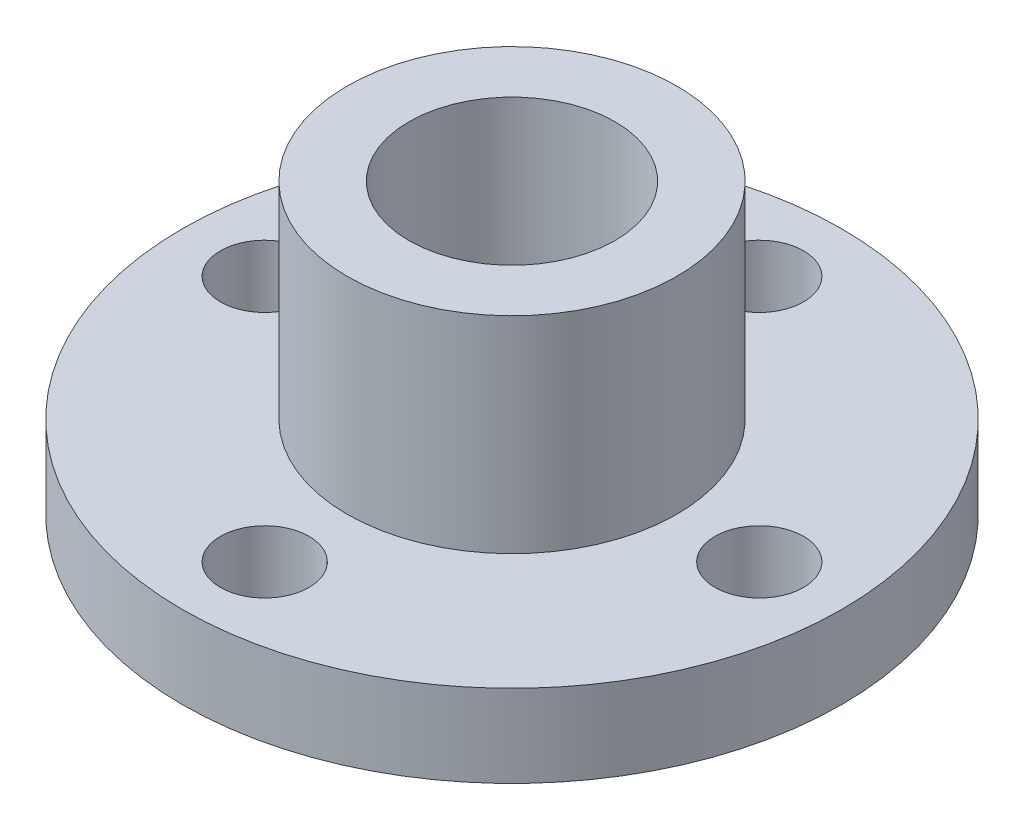
ISO-10303-21;
HEADER;
FILE_DESCRIPTION(('STEP AP214'),'2;1');
FILE_NAME('part.step','',(''),(''),'','','');
FILE_SCHEMA(('AUTOMOTIVE_DESIGN { 1 0 10303 214 1 1 1 1 }'));
ENDSEC;
DATA;
#1=APPLICATION_CONTEXT('core data for automotive mechanical design processes');
#2=APPLICATION_PROTOCOL_DEFINITION('international standard','automotive_design',2000,#1);
#3=PRODUCT_CONTEXT('',#1,'mechanical');
#4=PRODUCT('Part','Part','',(#3));
#5=PRODUCT_RELATED_PRODUCT_CATEGORY('part','',(#4));
#6=PRODUCT_DEFINITION_FORMATION('','',#4);
#7=PRODUCT_DEFINITION_CONTEXT('part definition',#1,'design');
#8=PRODUCT_DEFINITION('design','',#6,#7);
#9=PRODUCT_DEFINITION_SHAPE('','',#8);
#10=(LENGTH_UNIT() NAMED_UNIT(*) SI_UNIT(.MILLI.,.METRE.));
#11=(NAMED_UNIT(*) PLANE_ANGLE_UNIT() SI_UNIT($,.RADIAN.));
#12=(NAMED_UNIT(*) SI_UNIT($,.STERADIAN.) SOLID_ANGLE_UNIT());
#13=UNCERTAINTY_MEASURE_WITH_UNIT(LENGTH_MEASURE(1.E-05),#10,'distance_accuracy_value','');
#14=(GEOMETRIC_REPRESENTATION_CONTEXT(3) GLOBAL_UNCERTAINTY_ASSIGNED_CONTEXT((#13)) GLOBAL_UNIT_ASSIGNED_CONTEXT((#10,
#11,#12)) REPRESENTATION_CONTEXT('',''));
#15=CARTESIAN_POINT('',(0.,0.,0.));
#16=DIRECTION('',(0.,0.,1.));
#17=DIRECTION('',(1.,0.,0.));
#18=AXIS2_PLACEMENT_3D('',#15,#16,#17);
#19=CARTESIAN_POINT('',(0.,0.,-5.));
#20=DIRECTION('',(0.,-1.,0.));
#21=DIRECTION('',(0.,0.,-1.));
#22=AXIS2_PLACEMENT_3D('',#19,#20,#21);
#23=PLANE('',#22);
#24=CARTESIAN_POINT('',(0.,0.,0.));
#25=DIRECTION('',(0.,1.,0.));
#26=DIRECTION('',(0.,0.,1.));
#27=AXIS2_PLACEMENT_3D('',#24,#25,#26);
#28=CIRCLE('',#27,5.);
#29=CARTESIAN_POINT('',(0.,0.,5.));
#30=VERTEX_POINT('',#29);
#31=EDGE_CURVE('E64',#30,#30,#28,.T.);
#32=ORIENTED_EDGE('',*,*,#31,.F.);
#33=EDGE_LOOP('',(#32));
#34=FACE_BOUND('',#33,.T.);
#35=CARTESIAN_POINT('',(0.,0.,0.));
#36=DIRECTION('',(0.,1.,0.));
#37=DIRECTION('',(0.,0.,1.));
#38=AXIS2_PLACEMENT_3D('',#35,#36,#37);
#39=CIRCLE('',#38,8.);
#40=CARTESIAN_POINT('',(0.,0.,8.));
#41=VERTEX_POINT('',#40);
#42=EDGE_CURVE('E10',#41,#41,#39,.T.);
#43=ORIENTED_EDGE('',*,*,#42,.T.);
#44=EDGE_LOOP('',(#43));
#45=FACE_BOUND('',#44,.T.);
#46=ADVANCED_FACE('F37',(#34,#45),#23,.F.);
#47=CARTESIAN_POINT('',(0.,0.,0.));
#48=DIRECTION('',(0.,1.,0.));
#49=DIRECTION('',(0.,0.,1.));
#50=AXIS2_PLACEMENT_3D('',#47,#48,#49);
#51=CYLINDRICAL_SURFACE('',#50,8.);
#52=ORIENTED_EDGE('',*,*,#42,.F.);
#53=EDGE_LOOP('',(#52));
#54=FACE_BOUND('',#53,.T.);
#55=CARTESIAN_POINT('',(0.,-10.,0.));
#56=DIRECTION('',(0.,1.,0.));
#57=DIRECTION('',(0.,0.,1.));
#58=AXIS2_PLACEMENT_3D('',#55,#56,#57);
#59=CIRCLE('',#58,8.);
#60=CARTESIAN_POINT('',(0.,-10.,8.));
#61=VERTEX_POINT('',#60);
#62=EDGE_CURVE('E44',#61,#61,#59,.T.);
#63=ORIENTED_EDGE('',*,*,#62,.T.);
#64=EDGE_LOOP('',(#63));
#65=FACE_BOUND('',#64,.T.);
#66=ADVANCED_FACE('F115',(#54,#65),#51,.T.);
#67=CARTESIAN_POINT('',(0.,-10.,-8.));
#68=DIRECTION('',(0.,-1.,0.));
#69=DIRECTION('',(0.,0.,-1.));
#70=AXIS2_PLACEMENT_3D('',#67,#68,#69);
#71=PLANE('',#70);
#72=CARTESIAN_POINT('',(0.,-10.,-12.));
#73=DIRECTION('',(0.,1.,0.));
#74=DIRECTION('',(-1.,0.,0.));
#75=AXIS2_PLACEMENT_3D('',#72,#73,#74);
#76=CIRCLE('',#75,2.15);
#77=CARTESIAN_POINT('',(-2.14999999999996,-10.,-12.));
#78=VERTEX_POINT('',#77);
#79=EDGE_CURVE('E93',#78,#78,#76,.T.);
#80=ORIENTED_EDGE('',*,*,#79,.F.);
#81=EDGE_LOOP('',(#80));
#82=FACE_BOUND('',#81,.T.);
#83=CARTESIAN_POINT('',(12.,-10.,0.));
#84=DIRECTION('',(0.,1.,0.));
#85=DIRECTION('',(0.,0.,-1.));
#86=AXIS2_PLACEMENT_3D('',#83,#84,#85);
#87=CIRCLE('',#86,2.15);
#88=CARTESIAN_POINT('',(12.,-10.,-2.15));
#89=VERTEX_POINT('',#88);
#90=EDGE_CURVE('E85',#89,#89,#87,.T.);
#91=ORIENTED_EDGE('',*,*,#90,.F.);
#92=EDGE_LOOP('',(#91));
#93=FACE_BOUND('',#92,.T.);
#94=CARTESIAN_POINT('',(-1.25693328198353E-13,-10.,12.));
#95=DIRECTION('',(0.,1.,0.));
#96=DIRECTION('',(1.,0.,0.));
#97=AXIS2_PLACEMENT_3D('',#94,#95,#96);
#98=CIRCLE('',#97,2.15);
#99=CARTESIAN_POINT('',(2.14999999999987,-10.,12.));
#100=VERTEX_POINT('',#99);
#101=EDGE_CURVE('E77',#100,#100,#98,.T.);
#102=ORIENTED_EDGE('',*,*,#101,.F.);
#103=EDGE_LOOP('',(#102));
#104=FACE_BOUND('',#103,.T.);
#105=CARTESIAN_POINT('',(-12.,-10.,0.));
#106=DIRECTION('',(0.,1.,0.));
#107=DIRECTION('',(0.,0.,1.));
#108=AXIS2_PLACEMENT_3D('',#105,#106,#107);
#109=CIRCLE('',#108,2.15);
#110=CARTESIAN_POINT('',(-12.,-10.,2.15));
#111=VERTEX_POINT('',#110);
#112=EDGE_CURVE('E69',#111,#111,#109,.T.);
#113=ORIENTED_EDGE('',*,*,#112,.F.);
#114=EDGE_LOOP('',(#113));
#115=FACE_BOUND('',#114,.T.);
#116=ORIENTED_EDGE('',*,*,#62,.F.);
#117=EDGE_LOOP('',(#116));
#118=FACE_BOUND('',#117,.T.);
#119=CARTESIAN_POINT('',(0.,-10.,0.));
#120=DIRECTION('',(0.,1.,0.));
#121=DIRECTION('',(0.,0.,1.));
#122=AXIS2_PLACEMENT_3D('',#119,#120,#121);
#123=CIRCLE('',#122,16.);
#124=CARTESIAN_POINT('',(0.,-10.,16.));
#125=VERTEX_POINT('',#124);
#126=EDGE_CURVE('E49',#125,#125,#123,.T.);
#127=ORIENTED_EDGE('',*,*,#126,.T.);
#128=EDGE_LOOP('',(#127));
#129=FACE_BOUND('',#128,.T.);
#130=ADVANCED_FACE('F111',(#82,#93,#104,#115,#118,#129),#71,.F.);
#131=CARTESIAN_POINT('',(0.,0.,0.));
#132=DIRECTION('',(0.,1.,0.));
#133=DIRECTION('',(0.,0.,1.));
#134=AXIS2_PLACEMENT_3D('',#131,#132,#133);
#135=CYLINDRICAL_SURFACE('',#134,16.);
#136=ORIENTED_EDGE('',*,*,#126,.F.);
#137=EDGE_LOOP('',(#136));
#138=FACE_BOUND('',#137,.T.);
#139=CARTESIAN_POINT('',(0.,-14.,0.));
#140=DIRECTION('',(0.,1.,0.));
#141=DIRECTION('',(0.,0.,1.));
#142=AXIS2_PLACEMENT_3D('',#139,#140,#141);
#143=CIRCLE('',#142,16.);
#144=CARTESIAN_POINT('',(0.,-14.,16.));
#145=VERTEX_POINT('',#144);
#146=EDGE_CURVE('E54',#145,#145,#143,.T.);
#147=ORIENTED_EDGE('',*,*,#146,.T.);
#148=EDGE_LOOP('',(#147));
#149=FACE_BOUND('',#148,.T.);
#150=ADVANCED_FACE('F114',(#138,#149),#135,.T.);
#151=CARTESIAN_POINT('',(0.,-14.,-16.));
#152=DIRECTION('',(0.,1.,0.));
#153=DIRECTION('',(0.,0.,1.));
#154=AXIS2_PLACEMENT_3D('',#151,#152,#153);
#155=PLANE('',#154);
#156=CARTESIAN_POINT('',(0.,-14.,-12.));
#157=DIRECTION('',(0.,1.,0.));
#158=DIRECTION('',(-1.,0.,0.));
#159=AXIS2_PLACEMENT_3D('',#156,#157,#158);
#160=CIRCLE('',#159,2.15);
#161=CARTESIAN_POINT('',(-2.14999999999996,-14.,-12.));
#162=VERTEX_POINT('',#161);
#163=EDGE_CURVE('E73',#162,#162,#160,.T.);
#164=ORIENTED_EDGE('',*,*,#163,.T.);
#165=EDGE_LOOP('',(#164));
#166=FACE_BOUND('',#165,.T.);
#167=CARTESIAN_POINT('',(12.,-14.,0.));
#168=DIRECTION('',(0.,1.,0.));
#169=DIRECTION('',(0.,0.,-1.));
#170=AXIS2_PLACEMENT_3D('',#167,#168,#169);
#171=CIRCLE('',#170,2.15);
#172=CARTESIAN_POINT('',(12.,-14.,-2.15));
#173=VERTEX_POINT('',#172);
#174=EDGE_CURVE('E89',#173,#173,#171,.T.);
#175=ORIENTED_EDGE('',*,*,#174,.T.);
#176=EDGE_LOOP('',(#175));
#177=FACE_BOUND('',#176,.T.);
#178=CARTESIAN_POINT('',(-1.25693328198353E-13,-14.,12.));
#179=DIRECTION('',(0.,1.,0.));
#180=DIRECTION('',(1.,0.,0.));
#181=AXIS2_PLACEMENT_3D('',#178,#179,#180);
#182=CIRCLE('',#181,2.15);
#183=CARTESIAN_POINT('',(2.14999999999987,-14.,12.));
#184=VERTEX_POINT('',#183);
#185=EDGE_CURVE('E81',#184,#184,#182,.T.);
#186=ORIENTED_EDGE('',*,*,#185,.T.);
#187=EDGE_LOOP('',(#186));
#188=FACE_BOUND('',#187,.T.);
#189=CARTESIAN_POINT('',(-12.,-14.,0.));
#190=DIRECTION('',(0.,1.,0.));
#191=DIRECTION('',(0.,0.,1.));
#192=AXIS2_PLACEMENT_3D('',#189,#190,#191);
#193=CIRCLE('',#192,2.15);
#194=CARTESIAN_POINT('',(-12.,-14.,2.15));
#195=VERTEX_POINT('',#194);
#196=EDGE_CURVE('E68',#195,#195,#193,.T.);
#197=ORIENTED_EDGE('',*,*,#196,.T.);
#198=EDGE_LOOP('',(#197));
#199=FACE_BOUND('',#198,.T.);
#200=ORIENTED_EDGE('',*,*,#146,.F.);
#201=EDGE_LOOP('',(#200));
#202=FACE_BOUND('',#201,.T.);
#203=CARTESIAN_POINT('',(0.,-14.,0.));
#204=DIRECTION('',(0.,1.,0.));
#205=DIRECTION('',(0.,0.,1.));
#206=AXIS2_PLACEMENT_3D('',#203,#204,#205);
#207=CIRCLE('',#206,5.);
#208=CARTESIAN_POINT('',(0.,-14.,5.));
#209=VERTEX_POINT('',#208);
#210=EDGE_CURVE('E60',#209,#209,#207,.T.);
#211=ORIENTED_EDGE('',*,*,#210,.T.);
#212=EDGE_LOOP('',(#211));
#213=FACE_BOUND('',#212,.T.);
#214=ADVANCED_FACE('F101',(#166,#177,#188,#199,#202,#213),#155,.F.);
#215=CARTESIAN_POINT('',(0.,0.,0.));
#216=DIRECTION('',(0.,1.,0.));
#217=DIRECTION('',(0.,0.,1.));
#218=AXIS2_PLACEMENT_3D('',#215,#216,#217);
#219=CYLINDRICAL_SURFACE('',#218,5.);
#220=ORIENTED_EDGE('',*,*,#210,.F.);
#221=EDGE_LOOP('',(#220));
#222=FACE_BOUND('',#221,.T.);
#223=ORIENTED_EDGE('',*,*,#31,.T.);
#224=EDGE_LOOP('',(#223));
#225=FACE_BOUND('',#224,.T.);
#226=ADVANCED_FACE('F133',(#222,#225),#219,.F.);
#227=CARTESIAN_POINT('',(-12.,-14.,0.));
#228=DIRECTION('',(0.,1.,0.));
#229=DIRECTION('',(0.,0.,1.));
#230=AXIS2_PLACEMENT_3D('',#227,#228,#229);
#231=CYLINDRICAL_SURFACE('',#230,2.15);
#232=ORIENTED_EDGE('',*,*,#196,.F.);
#233=EDGE_LOOP('',(#232));
#234=FACE_BOUND('',#233,.T.);
#235=ORIENTED_EDGE('',*,*,#112,.T.);
#236=EDGE_LOOP('',(#235));
#237=FACE_BOUND('',#236,.T.);
#238=ADVANCED_FACE('F139',(#234,#237),#231,.F.);
#239=CARTESIAN_POINT('',(-1.25693328198353E-13,-14.,12.));
#240=DIRECTION('',(0.,1.,0.));
#241=DIRECTION('',(0.,0.,1.));
#242=AXIS2_PLACEMENT_3D('',#239,#240,#241);
#243=CYLINDRICAL_SURFACE('',#242,2.15);
#244=ORIENTED_EDGE('',*,*,#185,.F.);
#245=EDGE_LOOP('',(#244));
#246=FACE_BOUND('',#245,.T.);
#247=ORIENTED_EDGE('',*,*,#101,.T.);
#248=EDGE_LOOP('',(#247));
#249=FACE_BOUND('',#248,.T.);
#250=ADVANCED_FACE('F153',(#246,#249),#243,.F.);
#251=CARTESIAN_POINT('',(12.,-14.,0.));
#252=DIRECTION('',(0.,1.,0.));
#253=DIRECTION('',(0.,0.,1.));
#254=AXIS2_PLACEMENT_3D('',#251,#252,#253);
#255=CYLINDRICAL_SURFACE('',#254,2.15);
#256=ORIENTED_EDGE('',*,*,#174,.F.);
#257=EDGE_LOOP('',(#256));
#258=FACE_BOUND('',#257,.T.);
#259=ORIENTED_EDGE('',*,*,#90,.T.);
#260=EDGE_LOOP('',(#259));
#261=FACE_BOUND('',#260,.T.);
#262=ADVANCED_FACE('F107',(#258,#261),#255,.F.);
#263=CARTESIAN_POINT('',(0.,-14.,-12.));
#264=DIRECTION('',(0.,1.,0.));
#265=DIRECTION('',(0.,0.,1.));
#266=AXIS2_PLACEMENT_3D('',#263,#264,#265);
#267=CYLINDRICAL_SURFACE('',#266,2.15);
#268=ORIENTED_EDGE('',*,*,#163,.F.);
#269=EDGE_LOOP('',(#268));
#270=FACE_BOUND('',#269,.T.);
#271=ORIENTED_EDGE('',*,*,#79,.T.);
#272=EDGE_LOOP('',(#271));
#273=FACE_BOUND('',#272,.T.);
#274=ADVANCED_FACE('F104',(#270,#273),#267,.F.);
#275=CLOSED_SHELL('',(#46,#66,#130,#150,#214,#226,#238,#250,#262,#274));
#276=MANIFOLD_SOLID_BREP('B2',#275);
#277=ADVANCED_BREP_SHAPE_REPRESENTATION('',(#18,#276),#14);
#278=SHAPE_DEFINITION_REPRESENTATION(#9,#277);
ENDSEC;
END-ISO-10303-21;
